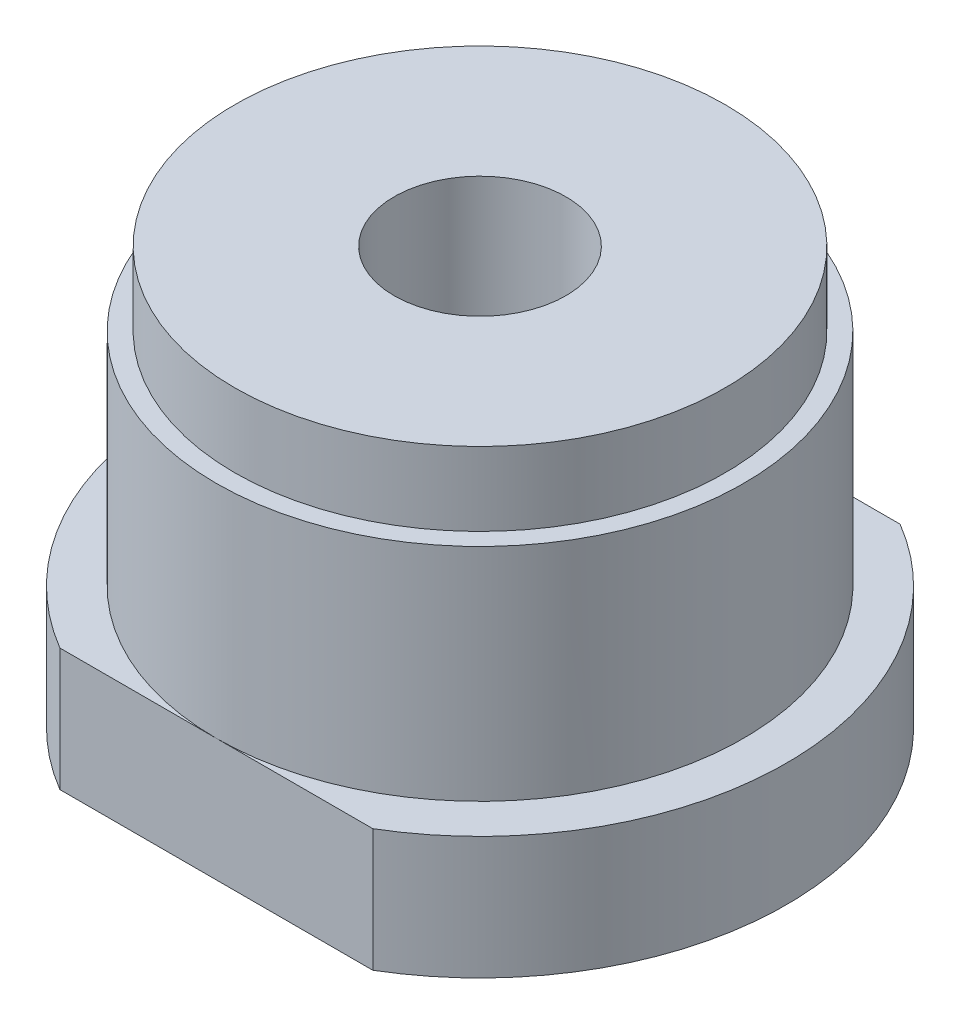
ISO-10303-21;
HEADER;
FILE_DESCRIPTION(('STEP AP214'),'2;1');
FILE_NAME('part.step','',(''),(''),'','','');
FILE_SCHEMA(('AUTOMOTIVE_DESIGN { 1 0 10303 214 1 1 1 1 }'));
ENDSEC;
DATA;
#1=APPLICATION_CONTEXT('core data for automotive mechanical design processes');
#2=APPLICATION_PROTOCOL_DEFINITION('international standard','automotive_design',2000,#1);
#3=PRODUCT_CONTEXT('',#1,'mechanical');
#4=PRODUCT('Part','Part','',(#3));
#5=PRODUCT_RELATED_PRODUCT_CATEGORY('part','',(#4));
#6=PRODUCT_DEFINITION_FORMATION('','',#4);
#7=PRODUCT_DEFINITION_CONTEXT('part definition',#1,'design');
#8=PRODUCT_DEFINITION('design','',#6,#7);
#9=PRODUCT_DEFINITION_SHAPE('','',#8);
#10=(LENGTH_UNIT() NAMED_UNIT(*) SI_UNIT(.MILLI.,.METRE.));
#11=(NAMED_UNIT(*) PLANE_ANGLE_UNIT() SI_UNIT($,.RADIAN.));
#12=(NAMED_UNIT(*) SI_UNIT($,.STERADIAN.) SOLID_ANGLE_UNIT());
#13=UNCERTAINTY_MEASURE_WITH_UNIT(LENGTH_MEASURE(1.E-05),#10,'distance_accuracy_value','');
#14=(GEOMETRIC_REPRESENTATION_CONTEXT(3) GLOBAL_UNCERTAINTY_ASSIGNED_CONTEXT((#13)) GLOBAL_UNIT_ASSIGNED_CONTEXT((#10,
#11,#12)) REPRESENTATION_CONTEXT('',''));
#15=CARTESIAN_POINT('',(0.,0.,0.));
#16=DIRECTION('',(0.,0.,1.));
#17=DIRECTION('',(1.,0.,0.));
#18=AXIS2_PLACEMENT_3D('',#15,#16,#17);
#19=CARTESIAN_POINT('',(0.,0.,0.));
#20=DIRECTION('',(0.,1.,0.));
#21=DIRECTION('',(0.,0.,1.));
#22=AXIS2_PLACEMENT_3D('',#19,#20,#21);
#23=PLANE('',#22);
#24=CARTESIAN_POINT('',(-8.,0.,0.));
#25=DIRECTION('',(0.,-1.,0.));
#26=DIRECTION('',(0.,0.,-1.));
#27=AXIS2_PLACEMENT_3D('',#24,#25,#26);
#28=CIRCLE('',#27,1.25);
#29=CARTESIAN_POINT('',(-8.,0.,-1.25));
#30=VERTEX_POINT('',#29);
#31=EDGE_CURVE('E145',#30,#30,#28,.T.);
#32=ORIENTED_EDGE('',*,*,#31,.F.);
#33=EDGE_LOOP('',(#32));
#34=FACE_BOUND('',#33,.T.);
#35=CARTESIAN_POINT('',(8.,0.,0.));
#36=DIRECTION('',(0.,1.,0.));
#37=DIRECTION('',(0.,0.,-1.));
#38=AXIS2_PLACEMENT_3D('',#35,#36,#37);
#39=CIRCLE('',#38,1.25);
#40=CARTESIAN_POINT('',(8.,0.,-1.25));
#41=VERTEX_POINT('',#40);
#42=EDGE_CURVE('E112',#41,#41,#39,.T.);
#43=ORIENTED_EDGE('',*,*,#42,.T.);
#44=EDGE_LOOP('',(#43));
#45=FACE_BOUND('',#44,.T.);
#46=DIRECTION('',(1.,0.,0.));
#47=VECTOR('',#46,1.);
#48=CARTESIAN_POINT('',(-11.0867579735155,0.,10.75));
#49=LINE('',#48,#47);
#50=CARTESIAN_POINT('',(-6.37867541108654,0.,10.75));
#51=VERTEX_POINT('',#50);
#52=CARTESIAN_POINT('',(6.37867541108654,0.,10.75));
#53=VERTEX_POINT('',#52);
#54=EDGE_CURVE('E320',#51,#53,#49,.T.);
#55=ORIENTED_EDGE('',*,*,#54,.F.);
#56=CARTESIAN_POINT('',(0.,0.,0.));
#57=DIRECTION('',(0.,1.,0.));
#58=DIRECTION('',(0.,0.,1.));
#59=AXIS2_PLACEMENT_3D('',#56,#57,#58);
#60=CIRCLE('',#59,12.5);
#61=CARTESIAN_POINT('',(-6.37867541108654,0.,-10.75));
#62=VERTEX_POINT('',#61);
#63=EDGE_CURVE('E93',#62,#51,#60,.T.);
#64=ORIENTED_EDGE('',*,*,#63,.F.);
#65=DIRECTION('',(1.,0.,0.));
#66=VECTOR('',#65,1.);
#67=CARTESIAN_POINT('',(-11.0867579735155,0.,-10.75));
#68=LINE('',#67,#66);
#69=CARTESIAN_POINT('',(6.37867541108654,0.,-10.75));
#70=VERTEX_POINT('',#69);
#71=EDGE_CURVE('E94',#62,#70,#68,.T.);
#72=ORIENTED_EDGE('',*,*,#71,.T.);
#73=EDGE_CURVE('E130',#53,#70,#60,.T.);
#74=ORIENTED_EDGE('',*,*,#73,.F.);
#75=EDGE_LOOP('',(#55,#64,#72,#74));
#76=FACE_BOUND('',#75,.T.);
#77=ADVANCED_FACE('F35',(#34,#45,#76),#23,.F.);
#78=CARTESIAN_POINT('',(0.,17.,0.));
#79=DIRECTION('',(0.,-1.,0.));
#80=DIRECTION('',(0.,0.,-1.));
#81=AXIS2_PLACEMENT_3D('',#78,#79,#80);
#82=CYLINDRICAL_SURFACE('',#81,12.5);
#83=DIRECTION('',(0.,-1.,0.));
#84=VECTOR('',#83,1.);
#85=CARTESIAN_POINT('',(-6.37867541108654,17.,10.75));
#86=LINE('',#85,#84);
#87=CARTESIAN_POINT('',(-6.37867541108654,5.,10.75));
#88=VERTEX_POINT('',#87);
#89=EDGE_CURVE('E82',#88,#51,#86,.T.);
#90=ORIENTED_EDGE('',*,*,#89,.F.);
#91=CARTESIAN_POINT('',(0.,5.,0.));
#92=DIRECTION('',(0.,1.,0.));
#93=DIRECTION('',(0.,0.,1.));
#94=AXIS2_PLACEMENT_3D('',#91,#92,#93);
#95=CIRCLE('',#94,12.5);
#96=CARTESIAN_POINT('',(-6.37867541108654,5.,-10.75));
#97=VERTEX_POINT('',#96);
#98=EDGE_CURVE('E91',#97,#88,#95,.T.);
#99=ORIENTED_EDGE('',*,*,#98,.F.);
#100=DIRECTION('',(0.,-1.,0.));
#101=VECTOR('',#100,1.);
#102=CARTESIAN_POINT('',(-6.37867541108654,17.,-10.75));
#103=LINE('',#102,#101);
#104=EDGE_CURVE('E132',#97,#62,#103,.T.);
#105=ORIENTED_EDGE('',*,*,#104,.T.);
#106=ORIENTED_EDGE('',*,*,#63,.T.);
#107=EDGE_LOOP('',(#90,#99,#105,#106));
#108=FACE_BOUND('',#107,.T.);
#109=ADVANCED_FACE('F37',(#108),#82,.T.);
#110=DIRECTION('',(0.,-1.,0.));
#111=VECTOR('',#110,1.);
#112=CARTESIAN_POINT('',(6.37867541108654,17.,10.75));
#113=LINE('',#112,#111);
#114=CARTESIAN_POINT('',(6.37867541108654,5.,10.75));
#115=VERTEX_POINT('',#114);
#116=EDGE_CURVE('E50',#53,#115,#113,.F.);
#117=ORIENTED_EDGE('',*,*,#116,.F.);
#118=ORIENTED_EDGE('',*,*,#73,.T.);
#119=DIRECTION('',(0.,-1.,0.));
#120=VECTOR('',#119,1.);
#121=CARTESIAN_POINT('',(6.37867541108654,17.,-10.75));
#122=LINE('',#121,#120);
#123=CARTESIAN_POINT('',(6.37867541108654,5.,-10.75));
#124=VERTEX_POINT('',#123);
#125=EDGE_CURVE('E129',#70,#124,#122,.F.);
#126=ORIENTED_EDGE('',*,*,#125,.T.);
#127=EDGE_CURVE('E100',#115,#124,#95,.T.);
#128=ORIENTED_EDGE('',*,*,#127,.F.);
#129=EDGE_LOOP('',(#117,#118,#126,#128));
#130=FACE_BOUND('',#129,.T.);
#131=ADVANCED_FACE('F127',(#130),#82,.T.);
#132=CARTESIAN_POINT('',(0.,5.,0.));
#133=DIRECTION('',(0.,1.,0.));
#134=DIRECTION('',(0.,0.,1.));
#135=AXIS2_PLACEMENT_3D('',#132,#133,#134);
#136=PLANE('',#135);
#137=ORIENTED_EDGE('',*,*,#98,.T.);
#138=DIRECTION('',(1.,0.,0.));
#139=VECTOR('',#138,1.);
#140=CARTESIAN_POINT('',(0.,5.,10.75));
#141=LINE('',#140,#139);
#142=CARTESIAN_POINT('',(0.,5.,10.75));
#143=VERTEX_POINT('',#142);
#144=EDGE_CURVE('E13',#88,#143,#141,.T.);
#145=ORIENTED_EDGE('',*,*,#144,.T.);
#146=CARTESIAN_POINT('',(0.,5.,0.));
#147=DIRECTION('',(0.,1.,0.));
#148=DIRECTION('',(0.,0.,1.));
#149=AXIS2_PLACEMENT_3D('',#146,#147,#148);
#150=CIRCLE('',#149,10.75);
#151=CARTESIAN_POINT('',(0.,5.,-10.75));
#152=VERTEX_POINT('',#151);
#153=EDGE_CURVE('E139',#152,#143,#150,.T.);
#154=ORIENTED_EDGE('',*,*,#153,.F.);
#155=DIRECTION('',(1.,0.,0.));
#156=VECTOR('',#155,1.);
#157=CARTESIAN_POINT('',(0.,5.,-10.75));
#158=LINE('',#157,#156);
#159=EDGE_CURVE('E98',#97,#152,#158,.T.);
#160=ORIENTED_EDGE('',*,*,#159,.F.);
#161=EDGE_LOOP('',(#137,#145,#154,#160));
#162=FACE_BOUND('',#161,.T.);
#163=ADVANCED_FACE('F97',(#162),#136,.T.);
#164=EDGE_CURVE('E57',#143,#152,#150,.T.);
#165=ORIENTED_EDGE('',*,*,#164,.F.);
#166=EDGE_CURVE('E39',#143,#115,#141,.T.);
#167=ORIENTED_EDGE('',*,*,#166,.T.);
#168=ORIENTED_EDGE('',*,*,#127,.T.);
#169=EDGE_CURVE('E116',#152,#124,#158,.T.);
#170=ORIENTED_EDGE('',*,*,#169,.F.);
#171=EDGE_LOOP('',(#165,#167,#168,#170));
#172=FACE_BOUND('',#171,.T.);
#173=ADVANCED_FACE('F125',(#172),#136,.T.);
#174=CARTESIAN_POINT('',(0.,17.,0.));
#175=DIRECTION('',(0.,1.,0.));
#176=DIRECTION('',(0.,0.,1.));
#177=AXIS2_PLACEMENT_3D('',#174,#175,#176);
#178=PLANE('',#177);
#179=CARTESIAN_POINT('',(0.,17.,0.));
#180=DIRECTION('',(0.,1.,0.));
#181=DIRECTION('',(0.,0.,1.));
#182=AXIS2_PLACEMENT_3D('',#179,#180,#181);
#183=CIRCLE('',#182,3.5);
#184=CARTESIAN_POINT('',(0.,17.,3.5));
#185=VERTEX_POINT('',#184);
#186=EDGE_CURVE('E99',#185,#185,#183,.T.);
#187=ORIENTED_EDGE('',*,*,#186,.F.);
#188=EDGE_LOOP('',(#187));
#189=FACE_BOUND('',#188,.T.);
#190=CARTESIAN_POINT('',(0.,17.,0.));
#191=DIRECTION('',(0.,1.,0.));
#192=DIRECTION('',(0.,0.,1.));
#193=AXIS2_PLACEMENT_3D('',#190,#191,#192);
#194=CIRCLE('',#193,10.);
#195=CARTESIAN_POINT('',(0.,17.,10.));
#196=VERTEX_POINT('',#195);
#197=EDGE_CURVE('E105',#196,#196,#194,.T.);
#198=ORIENTED_EDGE('',*,*,#197,.T.);
#199=EDGE_LOOP('',(#198));
#200=FACE_BOUND('',#199,.T.);
#201=ADVANCED_FACE('F166',(#189,#200),#178,.T.);
#202=CARTESIAN_POINT('',(0.,-9.89949493661167,0.));
#203=DIRECTION('',(0.,1.,0.));
#204=DIRECTION('',(0.,0.,1.));
#205=AXIS2_PLACEMENT_3D('',#202,#203,#204);
#206=CYLINDRICAL_SURFACE('',#205,3.5);
#207=CARTESIAN_POINT('',(0.,2.,0.));
#208=DIRECTION('',(0.,1.,0.));
#209=DIRECTION('',(0.,0.,1.));
#210=AXIS2_PLACEMENT_3D('',#207,#208,#209);
#211=CIRCLE('',#210,3.5);
#212=CARTESIAN_POINT('',(0.,2.,3.5));
#213=VERTEX_POINT('',#212);
#214=EDGE_CURVE('E103',#213,#213,#211,.F.);
#215=ORIENTED_EDGE('',*,*,#214,.T.);
#216=EDGE_LOOP('',(#215));
#217=FACE_BOUND('',#216,.T.);
#218=ORIENTED_EDGE('',*,*,#186,.T.);
#219=EDGE_LOOP('',(#218));
#220=FACE_BOUND('',#219,.T.);
#221=ADVANCED_FACE('F152',(#217,#220),#206,.F.);
#222=CARTESIAN_POINT('',(0.,2.,0.));
#223=DIRECTION('',(0.,1.,0.));
#224=DIRECTION('',(0.,0.,1.));
#225=AXIS2_PLACEMENT_3D('',#222,#223,#224);
#226=PLANE('',#225);
#227=ORIENTED_EDGE('',*,*,#214,.F.);
#228=EDGE_LOOP('',(#227));
#229=FACE_BOUND('',#228,.T.);
#230=ADVANCED_FACE('F155',(#229),#226,.T.);
#231=CARTESIAN_POINT('',(0.,-35.7088924499207,0.));
#232=DIRECTION('',(0.,1.,0.));
#233=DIRECTION('',(0.,0.,1.));
#234=AXIS2_PLACEMENT_3D('',#231,#232,#233);
#235=CYLINDRICAL_SURFACE('',#234,10.);
#236=CARTESIAN_POINT('',(0.,14.,0.));
#237=DIRECTION('',(0.,1.,0.));
#238=DIRECTION('',(0.,0.,1.));
#239=AXIS2_PLACEMENT_3D('',#236,#237,#238);
#240=CIRCLE('',#239,10.);
#241=CARTESIAN_POINT('',(0.,14.,10.));
#242=VERTEX_POINT('',#241);
#243=EDGE_CURVE('E114',#242,#242,#240,.F.);
#244=ORIENTED_EDGE('',*,*,#243,.F.);
#245=EDGE_LOOP('',(#244));
#246=FACE_BOUND('',#245,.T.);
#247=ORIENTED_EDGE('',*,*,#197,.F.);
#248=EDGE_LOOP('',(#247));
#249=FACE_BOUND('',#248,.T.);
#250=ADVANCED_FACE('F157',(#246,#249),#235,.T.);
#251=CARTESIAN_POINT('',(0.,14.,0.));
#252=DIRECTION('',(0.,1.,0.));
#253=DIRECTION('',(0.,0.,1.));
#254=AXIS2_PLACEMENT_3D('',#251,#252,#253);
#255=PLANE('',#254);
#256=ORIENTED_EDGE('',*,*,#243,.T.);
#257=EDGE_LOOP('',(#256));
#258=FACE_BOUND('',#257,.T.);
#259=CARTESIAN_POINT('',(0.,14.,0.));
#260=DIRECTION('',(0.,1.,0.));
#261=DIRECTION('',(0.,0.,1.));
#262=AXIS2_PLACEMENT_3D('',#259,#260,#261);
#263=CIRCLE('',#262,10.75);
#264=CARTESIAN_POINT('',(0.,14.,10.75));
#265=VERTEX_POINT('',#264);
#266=EDGE_CURVE('E113',#265,#265,#263,.T.);
#267=ORIENTED_EDGE('',*,*,#266,.T.);
#268=EDGE_LOOP('',(#267));
#269=FACE_BOUND('',#268,.T.);
#270=ADVANCED_FACE('F163',(#258,#269),#255,.T.);
#271=CARTESIAN_POINT('',(0.,14.,0.));
#272=DIRECTION('',(0.,-1.,0.));
#273=DIRECTION('',(0.,0.,-1.));
#274=AXIS2_PLACEMENT_3D('',#271,#272,#273);
#275=CYLINDRICAL_SURFACE('',#274,10.75);
#276=ORIENTED_EDGE('',*,*,#266,.F.);
#277=EDGE_LOOP('',(#276));
#278=FACE_BOUND('',#277,.T.);
#279=ORIENTED_EDGE('',*,*,#153,.T.);
#280=ORIENTED_EDGE('',*,*,#164,.T.);
#281=EDGE_LOOP('',(#279,#280));
#282=FACE_BOUND('',#281,.T.);
#283=ADVANCED_FACE('F194',(#278,#282),#275,.T.);
#284=CARTESIAN_POINT('',(-8.,10.,0.));
#285=DIRECTION('',(0.,-1.,0.));
#286=DIRECTION('',(0.,0.,-1.));
#287=AXIS2_PLACEMENT_3D('',#284,#285,#286);
#288=CYLINDRICAL_SURFACE('',#287,1.25);
#289=ORIENTED_EDGE('',*,*,#31,.T.);
#290=EDGE_LOOP('',(#289));
#291=FACE_BOUND('',#290,.T.);
#292=CARTESIAN_POINT('',(-8.,5.,0.));
#293=DIRECTION('',(0.,1.,0.));
#294=DIRECTION('',(0.,0.,1.));
#295=AXIS2_PLACEMENT_3D('',#292,#293,#294);
#296=CIRCLE('',#295,1.25);
#297=CARTESIAN_POINT('',(-8.,5.,1.25));
#298=VERTEX_POINT('',#297);
#299=EDGE_CURVE('E117',#298,#298,#296,.F.);
#300=ORIENTED_EDGE('',*,*,#299,.F.);
#301=EDGE_LOOP('',(#300));
#302=FACE_BOUND('',#301,.T.);
#303=ADVANCED_FACE('F190',(#291,#302),#288,.F.);
#304=CARTESIAN_POINT('',(8.,10.,0.));
#305=DIRECTION('',(0.,-1.,0.));
#306=DIRECTION('',(0.,0.,-1.));
#307=AXIS2_PLACEMENT_3D('',#304,#305,#306);
#308=CYLINDRICAL_SURFACE('',#307,1.25);
#309=ORIENTED_EDGE('',*,*,#42,.F.);
#310=EDGE_LOOP('',(#309));
#311=FACE_BOUND('',#310,.T.);
#312=CARTESIAN_POINT('',(8.,5.,0.));
#313=DIRECTION('',(0.,1.,0.));
#314=DIRECTION('',(0.,0.,1.));
#315=AXIS2_PLACEMENT_3D('',#312,#313,#314);
#316=CIRCLE('',#315,1.25);
#317=CARTESIAN_POINT('',(8.,5.,1.25));
#318=VERTEX_POINT('',#317);
#319=EDGE_CURVE('E109',#318,#318,#316,.T.);
#320=ORIENTED_EDGE('',*,*,#319,.T.);
#321=EDGE_LOOP('',(#320));
#322=FACE_BOUND('',#321,.T.);
#323=ADVANCED_FACE('F193',(#311,#322),#308,.F.);
#324=CARTESIAN_POINT('',(0.,5.,0.));
#325=DIRECTION('',(0.,1.,0.));
#326=DIRECTION('',(0.,0.,1.));
#327=AXIS2_PLACEMENT_3D('',#324,#325,#326);
#328=PLANE('',#327);
#329=ORIENTED_EDGE('',*,*,#319,.F.);
#330=EDGE_LOOP('',(#329));
#331=FACE_BOUND('',#330,.T.);
#332=ADVANCED_FACE('F198',(#331),#328,.F.);
#333=ORIENTED_EDGE('',*,*,#299,.T.);
#334=EDGE_LOOP('',(#333));
#335=FACE_BOUND('',#334,.T.);
#336=ADVANCED_FACE('F203',(#335),#328,.F.);
#337=CARTESIAN_POINT('',(-11.0867579735155,0.,-10.75));
#338=DIRECTION('',(0.,0.,1.));
#339=DIRECTION('',(1.,0.,0.));
#340=AXIS2_PLACEMENT_3D('',#337,#338,#339);
#341=PLANE('',#340);
#342=ORIENTED_EDGE('',*,*,#159,.T.);
#343=ORIENTED_EDGE('',*,*,#169,.T.);
#344=ORIENTED_EDGE('',*,*,#125,.F.);
#345=ORIENTED_EDGE('',*,*,#71,.F.);
#346=ORIENTED_EDGE('',*,*,#104,.F.);
#347=EDGE_LOOP('',(#342,#343,#344,#345,#346));
#348=FACE_BOUND('',#347,.T.);
#349=ADVANCED_FACE('F206',(#348),#341,.F.);
#350=CARTESIAN_POINT('',(-11.0867579735155,0.,10.75));
#351=DIRECTION('',(0.,0.,1.));
#352=DIRECTION('',(1.,0.,0.));
#353=AXIS2_PLACEMENT_3D('',#350,#351,#352);
#354=PLANE('',#353);
#355=ORIENTED_EDGE('',*,*,#89,.T.);
#356=ORIENTED_EDGE('',*,*,#54,.T.);
#357=ORIENTED_EDGE('',*,*,#116,.T.);
#358=ORIENTED_EDGE('',*,*,#166,.F.);
#359=ORIENTED_EDGE('',*,*,#144,.F.);
#360=EDGE_LOOP('',(#355,#356,#357,#358,#359));
#361=FACE_BOUND('',#360,.T.);
#362=ADVANCED_FACE('F81',(#361),#354,.T.);
#363=CLOSED_SHELL('',(#77,#109,#131,#163,#173,#201,#221,#230,#250,#270,#283,#303,#323,#332,#336,
#349,#362));
#364=MANIFOLD_SOLID_BREP('B2',#363);
#365=ADVANCED_BREP_SHAPE_REPRESENTATION('',(#18,#364),#14);
#366=SHAPE_DEFINITION_REPRESENTATION(#9,#365);
ENDSEC;
END-ISO-10303-21;
